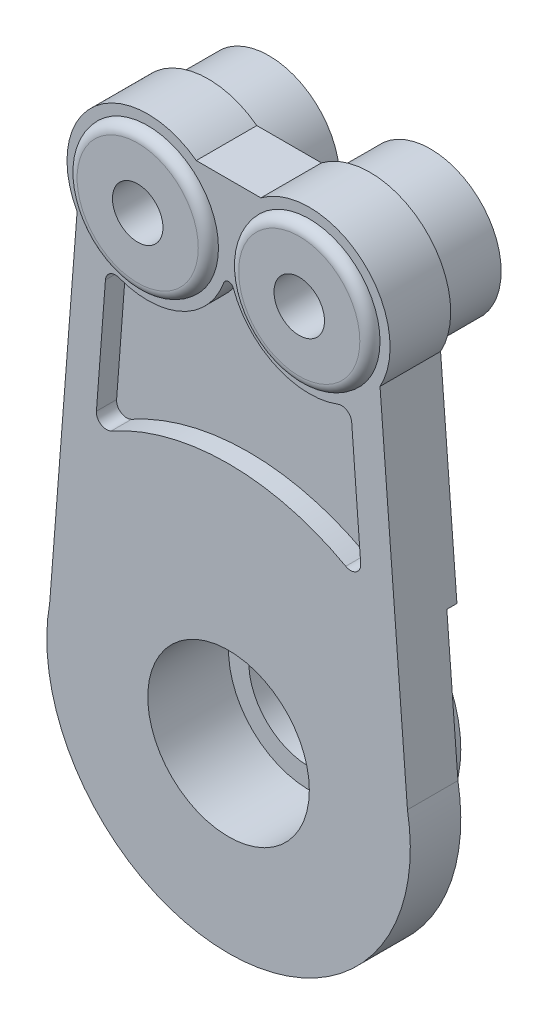
ISO-10303-21;
HEADER;
FILE_DESCRIPTION(('STEP AP214'),'2;1');
FILE_NAME('part.step','',(''),(''),'','','');
FILE_SCHEMA(('AUTOMOTIVE_DESIGN { 1 0 10303 214 1 1 1 1 }'));
ENDSEC;
DATA;
#1=APPLICATION_CONTEXT('core data for automotive mechanical design processes');
#2=APPLICATION_PROTOCOL_DEFINITION('international standard','automotive_design',2000,#1);
#3=PRODUCT_CONTEXT('',#1,'mechanical');
#4=PRODUCT('Part','Part','',(#3));
#5=PRODUCT_RELATED_PRODUCT_CATEGORY('part','',(#4));
#6=PRODUCT_DEFINITION_FORMATION('','',#4);
#7=PRODUCT_DEFINITION_CONTEXT('part definition',#1,'design');
#8=PRODUCT_DEFINITION('design','',#6,#7);
#9=PRODUCT_DEFINITION_SHAPE('','',#8);
#10=(LENGTH_UNIT() NAMED_UNIT(*) SI_UNIT(.MILLI.,.METRE.));
#11=(NAMED_UNIT(*) PLANE_ANGLE_UNIT() SI_UNIT($,.RADIAN.));
#12=(NAMED_UNIT(*) SI_UNIT($,.STERADIAN.) SOLID_ANGLE_UNIT());
#13=UNCERTAINTY_MEASURE_WITH_UNIT(LENGTH_MEASURE(1.E-05),#10,'distance_accuracy_value','');
#14=(GEOMETRIC_REPRESENTATION_CONTEXT(3) GLOBAL_UNCERTAINTY_ASSIGNED_CONTEXT((#13)) GLOBAL_UNIT_ASSIGNED_CONTEXT((#10,
#11,#12)) REPRESENTATION_CONTEXT('',''));
#15=CARTESIAN_POINT('',(0.,0.,0.));
#16=DIRECTION('',(0.,0.,1.));
#17=DIRECTION('',(1.,0.,0.));
#18=AXIS2_PLACEMENT_3D('',#15,#16,#17);
#19=CARTESIAN_POINT('',(0.,0.,0.5));
#20=DIRECTION('',(0.,0.,-1.));
#21=DIRECTION('',(-1.,0.,0.));
#22=AXIS2_PLACEMENT_3D('',#19,#20,#21);
#23=PLANE('',#22);
#24=CARTESIAN_POINT('',(0.,0.,0.5));
#25=DIRECTION('',(0.,0.,-1.));
#26=DIRECTION('',(-1.,0.,0.));
#27=AXIS2_PLACEMENT_3D('',#24,#25,#26);
#28=CIRCLE('',#27,9.);
#29=CARTESIAN_POINT('',(8.85870728557091,1.58849149464924,0.5));
#30=VERTEX_POINT('',#29);
#31=CARTESIAN_POINT('',(1.5,-8.87411967464942,0.5));
#32=VERTEX_POINT('',#31);
#33=EDGE_CURVE('E204',#30,#32,#28,.T.);
#34=ORIENTED_EDGE('',*,*,#33,.T.);
#35=DIRECTION('',(0.,-1.,0.));
#36=VECTOR('',#35,1.);
#37=CARTESIAN_POINT('',(1.5,-5.80947501931113,0.5));
#38=LINE('',#37,#36);
#39=CARTESIAN_POINT('',(1.5,-5.80947501931113,0.5));
#40=VERTEX_POINT('',#39);
#41=EDGE_CURVE('E185',#40,#32,#38,.T.);
#42=ORIENTED_EDGE('',*,*,#41,.F.);
#43=CARTESIAN_POINT('',(0.,0.,0.5));
#44=DIRECTION('',(0.,0.,-1.));
#45=DIRECTION('',(-1.,0.,0.));
#46=AXIS2_PLACEMENT_3D('',#43,#44,#45);
#47=CIRCLE('',#46,6.);
#48=CARTESIAN_POINT('',(-1.5,-5.80947501931113,0.5));
#49=VERTEX_POINT('',#48);
#50=EDGE_CURVE('E196',#49,#40,#47,.T.);
#51=ORIENTED_EDGE('',*,*,#50,.F.);
#52=DIRECTION('',(0.,1.,0.));
#53=VECTOR('',#52,1.);
#54=CARTESIAN_POINT('',(-1.5,-5.80947501931113,0.5));
#55=LINE('',#54,#53);
#56=CARTESIAN_POINT('',(-1.5,-8.87411967464942,0.5));
#57=VERTEX_POINT('',#56);
#58=EDGE_CURVE('E205',#57,#49,#55,.T.);
#59=ORIENTED_EDGE('',*,*,#58,.F.);
#60=CARTESIAN_POINT('',(-8.85870728557089,1.5884914946493,0.5));
#61=VERTEX_POINT('',#60);
#62=EDGE_CURVE('E222',#57,#61,#28,.T.);
#63=ORIENTED_EDGE('',*,*,#62,.T.);
#64=DIRECTION('',(0.0775174605559631,0.996990994597722,0.));
#65=VECTOR('',#64,1.);
#66=CARTESIAN_POINT('',(-8.85870728557089,1.58849149464931,0.5));
#67=LINE('',#66,#65);
#68=CARTESIAN_POINT('',(-8.30904862225171,8.6579276384743,0.5));
#69=VERTEX_POINT('',#68);
#70=EDGE_CURVE('E224',#61,#69,#67,.T.);
#71=ORIENTED_EDGE('',*,*,#70,.T.);
#72=CARTESIAN_POINT('',(0.,0.,0.5));
#73=DIRECTION('',(0.,0.,-1.));
#74=DIRECTION('',(-1.,0.,0.));
#75=AXIS2_PLACEMENT_3D('',#72,#73,#74);
#76=CIRCLE('',#75,12.);
#77=CARTESIAN_POINT('',(8.30904862225171,8.65792763847429,0.5));
#78=VERTEX_POINT('',#77);
#79=EDGE_CURVE('E54',#69,#78,#76,.T.);
#80=ORIENTED_EDGE('',*,*,#79,.T.);
#81=DIRECTION('',(0.0775174605559635,-0.996990994597722,0.));
#82=VECTOR('',#81,1.);
#83=CARTESIAN_POINT('',(8.85870728557091,1.58849149464924,0.5));
#84=LINE('',#83,#82);
#85=EDGE_CURVE('E39',#78,#30,#84,.T.);
#86=ORIENTED_EDGE('',*,*,#85,.T.);
#87=EDGE_LOOP('',(#34,#42,#51,#59,#63,#71,#80,#86));
#88=FACE_BOUND('',#87,.T.);
#89=ADVANCED_FACE('F31',(#88),#23,.T.);
#90=CARTESIAN_POINT('',(0.,0.,3.));
#91=DIRECTION('',(0.,0.,-1.));
#92=DIRECTION('',(-1.,0.,0.));
#93=AXIS2_PLACEMENT_3D('',#90,#91,#92);
#94=CYLINDRICAL_SURFACE('',#93,9.);
#95=ORIENTED_EDGE('',*,*,#33,.F.);
#96=DIRECTION('',(0.,0.,-1.));
#97=VECTOR('',#96,1.);
#98=CARTESIAN_POINT('',(8.85870728557091,1.58849149464924,3.));
#99=LINE('',#98,#97);
#100=CARTESIAN_POINT('',(8.85870728557091,1.58849149464924,3.));
#101=VERTEX_POINT('',#100);
#102=EDGE_CURVE('E367',#101,#30,#99,.T.);
#103=ORIENTED_EDGE('',*,*,#102,.F.);
#104=CARTESIAN_POINT('',(0.,0.,3.));
#105=DIRECTION('',(0.,0.,1.));
#106=DIRECTION('',(1.,0.,0.));
#107=AXIS2_PLACEMENT_3D('',#104,#105,#106);
#108=CIRCLE('',#107,9.);
#109=CARTESIAN_POINT('',(-8.85870728557089,1.5884914946493,3.));
#110=VERTEX_POINT('',#109);
#111=EDGE_CURVE('E350',#110,#101,#108,.T.);
#112=ORIENTED_EDGE('',*,*,#111,.F.);
#113=DIRECTION('',(0.,0.,-1.));
#114=VECTOR('',#113,1.);
#115=CARTESIAN_POINT('',(-8.85870728557089,1.5884914946493,3.));
#116=LINE('',#115,#114);
#117=EDGE_CURVE('E370',#110,#61,#116,.T.);
#118=ORIENTED_EDGE('',*,*,#117,.T.);
#119=ORIENTED_EDGE('',*,*,#62,.F.);
#120=DIRECTION('',(0.,0.,1.));
#121=VECTOR('',#120,1.);
#122=CARTESIAN_POINT('',(-1.5,-8.87411967464942,-2.5));
#123=LINE('',#122,#121);
#124=CARTESIAN_POINT('',(-1.5,-8.87411967464942,-2.5));
#125=VERTEX_POINT('',#124);
#126=EDGE_CURVE('E46',#125,#57,#123,.T.);
#127=ORIENTED_EDGE('',*,*,#126,.F.);
#128=CARTESIAN_POINT('',(0.,0.,-2.5));
#129=DIRECTION('',(0.,0.,-1.));
#130=DIRECTION('',(-1.,0.,0.));
#131=AXIS2_PLACEMENT_3D('',#128,#129,#130);
#132=CIRCLE('',#131,9.);
#133=CARTESIAN_POINT('',(1.5,-8.87411967464942,-2.5));
#134=VERTEX_POINT('',#133);
#135=EDGE_CURVE('E213',#134,#125,#132,.T.);
#136=ORIENTED_EDGE('',*,*,#135,.F.);
#137=DIRECTION('',(0.,0.,1.));
#138=VECTOR('',#137,1.);
#139=CARTESIAN_POINT('',(1.5,-8.87411967464942,-2.5));
#140=LINE('',#139,#138);
#141=EDGE_CURVE('E192',#134,#32,#140,.T.);
#142=ORIENTED_EDGE('',*,*,#141,.T.);
#143=EDGE_LOOP('',(#95,#103,#112,#118,#119,#127,#136,#142));
#144=FACE_BOUND('',#143,.T.);
#145=ADVANCED_FACE('F391',(#144),#94,.T.);
#146=CARTESIAN_POINT('',(-4.,21.,0.));
#147=DIRECTION('',(0.,0.,1.));
#148=DIRECTION('',(1.,0.,0.));
#149=AXIS2_PLACEMENT_3D('',#146,#147,#148);
#150=PLANE('',#149);
#151=CARTESIAN_POINT('',(-4.,21.,0.));
#152=DIRECTION('',(0.,0.,1.));
#153=DIRECTION('',(1.,0.,0.));
#154=AXIS2_PLACEMENT_3D('',#151,#152,#153);
#155=CIRCLE('',#154,3.5);
#156=CARTESIAN_POINT('',(-0.5,21.,0.));
#157=VERTEX_POINT('',#156);
#158=EDGE_CURVE('E382',#157,#157,#155,.F.);
#159=ORIENTED_EDGE('',*,*,#158,.F.);
#160=EDGE_LOOP('',(#159));
#161=FACE_BOUND('',#160,.T.);
#162=DIRECTION('',(-0.0775174605559635,0.996990994597722,0.));
#163=VECTOR('',#162,1.);
#164=CARTESIAN_POINT('',(8.85870728557091,1.58849149464924,0.));
#165=LINE('',#164,#163);
#166=CARTESIAN_POINT('',(8.30904862225171,8.65792763847429,0.));
#167=VERTEX_POINT('',#166);
#168=CARTESIAN_POINT('',(7.5,19.0635083268963,0.));
#169=VERTEX_POINT('',#168);
#170=EDGE_CURVE('E339',#167,#169,#165,.T.);
#171=ORIENTED_EDGE('',*,*,#170,.F.);
#172=CARTESIAN_POINT('',(0.,0.,0.));
#173=DIRECTION('',(0.,0.,-1.));
#174=DIRECTION('',(-1.,0.,0.));
#175=AXIS2_PLACEMENT_3D('',#172,#173,#174);
#176=CIRCLE('',#175,12.);
#177=CARTESIAN_POINT('',(-8.30904862225171,8.6579276384743,0.));
#178=VERTEX_POINT('',#177);
#179=EDGE_CURVE('E191',#178,#167,#176,.T.);
#180=ORIENTED_EDGE('',*,*,#179,.F.);
#181=DIRECTION('',(-0.0775174605559631,-0.996990994597722,0.));
#182=VECTOR('',#181,1.);
#183=CARTESIAN_POINT('',(-8.85870728557089,1.58849149464931,0.));
#184=LINE('',#183,#182);
#185=CARTESIAN_POINT('',(-7.5,19.0635083268963,0.));
#186=VERTEX_POINT('',#185);
#187=EDGE_CURVE('E336',#186,#178,#184,.T.);
#188=ORIENTED_EDGE('',*,*,#187,.F.);
#189=CARTESIAN_POINT('',(-4.,21.,0.));
#190=DIRECTION('',(0.,0.,1.));
#191=DIRECTION('',(1.,0.,0.));
#192=AXIS2_PLACEMENT_3D('',#189,#190,#191);
#193=CIRCLE('',#192,4.);
#194=CARTESIAN_POINT('',(-1.6,24.2,0.));
#195=VERTEX_POINT('',#194);
#196=EDGE_CURVE('E333',#195,#186,#193,.T.);
#197=ORIENTED_EDGE('',*,*,#196,.F.);
#198=DIRECTION('',(-1.,0.,0.));
#199=VECTOR('',#198,1.);
#200=CARTESIAN_POINT('',(1.6,24.2,0.));
#201=LINE('',#200,#199);
#202=CARTESIAN_POINT('',(1.6,24.2,0.));
#203=VERTEX_POINT('',#202);
#204=EDGE_CURVE('E343',#203,#195,#201,.T.);
#205=ORIENTED_EDGE('',*,*,#204,.F.);
#206=CARTESIAN_POINT('',(4.,21.,0.));
#207=DIRECTION('',(0.,0.,1.));
#208=DIRECTION('',(-1.,0.,0.));
#209=AXIS2_PLACEMENT_3D('',#206,#207,#208);
#210=CIRCLE('',#209,4.);
#211=EDGE_CURVE('E341',#169,#203,#210,.T.);
#212=ORIENTED_EDGE('',*,*,#211,.F.);
#213=EDGE_LOOP('',(#171,#180,#188,#197,#205,#212));
#214=FACE_BOUND('',#213,.T.);
#215=CARTESIAN_POINT('',(4.,21.,0.));
#216=DIRECTION('',(0.,0.,1.));
#217=DIRECTION('',(1.,0.,0.));
#218=AXIS2_PLACEMENT_3D('',#215,#216,#217);
#219=CIRCLE('',#218,3.5);
#220=CARTESIAN_POINT('',(7.5,21.,0.));
#221=VERTEX_POINT('',#220);
#222=EDGE_CURVE('E385',#221,#221,#219,.F.);
#223=ORIENTED_EDGE('',*,*,#222,.F.);
#224=EDGE_LOOP('',(#223));
#225=FACE_BOUND('',#224,.T.);
#226=ADVANCED_FACE('F413',(#161,#214,#225),#150,.F.);
#227=CARTESIAN_POINT('',(-4.,21.,3.));
#228=DIRECTION('',(0.,0.,1.));
#229=DIRECTION('',(1.,0.,0.));
#230=AXIS2_PLACEMENT_3D('',#227,#228,#229);
#231=PLANE('',#230);
#232=CARTESIAN_POINT('',(0.,0.,3.));
#233=DIRECTION('',(0.,0.,1.));
#234=DIRECTION('',(1.,0.,0.));
#235=AXIS2_PLACEMENT_3D('',#232,#233,#234);
#236=CIRCLE('',#235,4.);
#237=CARTESIAN_POINT('',(4.,0.,3.));
#238=VERTEX_POINT('',#237);
#239=EDGE_CURVE('E792',#238,#238,#236,.T.);
#240=ORIENTED_EDGE('',*,*,#239,.F.);
#241=EDGE_LOOP('',(#240));
#242=FACE_BOUND('',#241,.T.);
#243=CARTESIAN_POINT('',(-6.04517538410995,10.9410170722539,3.));
#244=DIRECTION('',(0.,0.,1.));
#245=DIRECTION('',(1.,0.,0.));
#246=AXIS2_PLACEMENT_3D('',#243,#244,#245);
#247=CIRCLE('',#246,0.500000000000001);
#248=CARTESIAN_POINT('',(-6.54372583212428,10.9790624502217,3.));
#249=VERTEX_POINT('',#248);
#250=CARTESIAN_POINT('',(-5.80336836874556,10.5033763893637,3.));
#251=VERTEX_POINT('',#250);
#252=EDGE_CURVE('E247',#249,#251,#247,.T.);
#253=ORIENTED_EDGE('',*,*,#252,.F.);
#254=DIRECTION('',(-0.0760907559356129,-0.997100896028655,0.));
#255=VECTOR('',#254,1.);
#256=CARTESIAN_POINT('',(-6.54372583212428,10.9790624502217,3.));
#257=LINE('',#256,#255);
#258=CARTESIAN_POINT('',(-6.0971108584144,16.8315498514872,3.));
#259=VERTEX_POINT('',#258);
#260=EDGE_CURVE('E273',#259,#249,#257,.T.);
#261=ORIENTED_EDGE('',*,*,#260,.F.);
#262=CARTESIAN_POINT('',(-5.59856041040007,16.7935044735194,3.));
#263=DIRECTION('',(0.,0.,1.));
#264=DIRECTION('',(-1.,0.,0.));
#265=AXIS2_PLACEMENT_3D('',#262,#263,#264);
#266=CIRCLE('',#265,0.500000000000002);
#267=CARTESIAN_POINT('',(-5.42094258702228,17.2608928653505,3.));
#268=VERTEX_POINT('',#267);
#269=EDGE_CURVE('E270',#268,#259,#266,.T.);
#270=ORIENTED_EDGE('',*,*,#269,.F.);
#271=CARTESIAN_POINT('',(-4.,21.,3.));
#272=DIRECTION('',(0.,0.,-1.));
#273=DIRECTION('',(1.,0.,0.));
#274=AXIS2_PLACEMENT_3D('',#271,#272,#273);
#275=CIRCLE('',#274,4.);
#276=CARTESIAN_POINT('',(-0.23529411764706,19.6483382008146,3.));
#277=VERTEX_POINT('',#276);
#278=EDGE_CURVE('E267',#277,#268,#275,.T.);
#279=ORIENTED_EDGE('',*,*,#278,.F.);
#280=CARTESIAN_POINT('',(0.,19.5638593383655,3.));
#281=DIRECTION('',(0.,0.,1.));
#282=DIRECTION('',(-1.,0.,0.));
#283=AXIS2_PLACEMENT_3D('',#280,#281,#282);
#284=CIRCLE('',#283,0.250000000000001);
#285=CARTESIAN_POINT('',(0.235294117647059,19.6483382008146,3.));
#286=VERTEX_POINT('',#285);
#287=EDGE_CURVE('E264',#286,#277,#284,.T.);
#288=ORIENTED_EDGE('',*,*,#287,.F.);
#289=CARTESIAN_POINT('',(4.,21.,3.));
#290=DIRECTION('',(0.,0.,-1.));
#291=DIRECTION('',(1.,0.,0.));
#292=AXIS2_PLACEMENT_3D('',#289,#290,#291);
#293=CIRCLE('',#292,4.);
#294=CARTESIAN_POINT('',(5.42094258702228,17.2608928653505,3.));
#295=VERTEX_POINT('',#294);
#296=EDGE_CURVE('E261',#295,#286,#293,.T.);
#297=ORIENTED_EDGE('',*,*,#296,.F.);
#298=CARTESIAN_POINT('',(5.59856041040007,16.7935044735194,3.));
#299=DIRECTION('',(0.,0.,1.));
#300=DIRECTION('',(-1.,0.,0.));
#301=AXIS2_PLACEMENT_3D('',#298,#299,#300);
#302=CIRCLE('',#301,0.5);
#303=CARTESIAN_POINT('',(6.0971108584144,16.8315498514872,3.));
#304=VERTEX_POINT('',#303);
#305=EDGE_CURVE('E258',#304,#295,#302,.T.);
#306=ORIENTED_EDGE('',*,*,#305,.F.);
#307=DIRECTION('',(-0.0760907559356129,0.997100896028655,0.));
#308=VECTOR('',#307,1.);
#309=CARTESIAN_POINT('',(6.54372583212428,10.9790624502217,3.));
#310=LINE('',#309,#308);
#311=CARTESIAN_POINT('',(6.54372583212428,10.9790624502217,3.));
#312=VERTEX_POINT('',#311);
#313=EDGE_CURVE('E255',#312,#304,#310,.T.);
#314=ORIENTED_EDGE('',*,*,#313,.F.);
#315=CARTESIAN_POINT('',(6.04517538410995,10.9410170722539,3.));
#316=DIRECTION('',(0.,0.,1.));
#317=DIRECTION('',(-1.,0.,0.));
#318=AXIS2_PLACEMENT_3D('',#315,#316,#317);
#319=CIRCLE('',#318,0.499999999999999);
#320=CARTESIAN_POINT('',(5.80336836874556,10.5033763893637,3.));
#321=VERTEX_POINT('',#320);
#322=EDGE_CURVE('E252',#321,#312,#319,.T.);
#323=ORIENTED_EDGE('',*,*,#322,.F.);
#324=CARTESIAN_POINT('',(0.,0.,3.));
#325=DIRECTION('',(0.,0.,-1.));
#326=DIRECTION('',(1.,0.,0.));
#327=AXIS2_PLACEMENT_3D('',#324,#325,#326);
#328=CIRCLE('',#327,12.);
#329=EDGE_CURVE('E249',#251,#321,#328,.T.);
#330=ORIENTED_EDGE('',*,*,#329,.F.);
#331=EDGE_LOOP('',(#253,#261,#270,#279,#288,#297,#306,#314,#323,#330));
#332=FACE_BOUND('',#331,.T.);
#333=CARTESIAN_POINT('',(4.,21.,3.));
#334=DIRECTION('',(0.,0.,1.));
#335=DIRECTION('',(1.,0.,0.));
#336=AXIS2_PLACEMENT_3D('',#333,#334,#335);
#337=CIRCLE('',#336,3.5);
#338=CARTESIAN_POINT('',(7.5,21.,3.));
#339=VERTEX_POINT('',#338);
#340=EDGE_CURVE('E330',#339,#339,#337,.T.);
#341=ORIENTED_EDGE('',*,*,#340,.F.);
#342=EDGE_LOOP('',(#341));
#343=FACE_BOUND('',#342,.T.);
#344=CARTESIAN_POINT('',(-4.,21.,3.));
#345=DIRECTION('',(0.,0.,1.));
#346=DIRECTION('',(1.,0.,0.));
#347=AXIS2_PLACEMENT_3D('',#344,#345,#346);
#348=CIRCLE('',#347,4.);
#349=CARTESIAN_POINT('',(-1.6,24.2,3.));
#350=VERTEX_POINT('',#349);
#351=CARTESIAN_POINT('',(-7.5,19.0635083268963,3.));
#352=VERTEX_POINT('',#351);
#353=EDGE_CURVE('E345',#350,#352,#348,.T.);
#354=ORIENTED_EDGE('',*,*,#353,.T.);
#355=DIRECTION('',(-0.0775174605559631,-0.996990994597722,0.));
#356=VECTOR('',#355,1.);
#357=CARTESIAN_POINT('',(-8.85870728557089,1.58849149464931,3.));
#358=LINE('',#357,#356);
#359=EDGE_CURVE('E348',#352,#110,#358,.T.);
#360=ORIENTED_EDGE('',*,*,#359,.T.);
#361=ORIENTED_EDGE('',*,*,#111,.T.);
#362=DIRECTION('',(-0.0775174605559635,0.996990994597722,0.));
#363=VECTOR('',#362,1.);
#364=CARTESIAN_POINT('',(8.85870728557091,1.58849149464924,3.));
#365=LINE('',#364,#363);
#366=CARTESIAN_POINT('',(7.5,19.0635083268963,3.));
#367=VERTEX_POINT('',#366);
#368=EDGE_CURVE('E352',#101,#367,#365,.T.);
#369=ORIENTED_EDGE('',*,*,#368,.T.);
#370=CARTESIAN_POINT('',(4.,21.,3.));
#371=DIRECTION('',(0.,0.,1.));
#372=DIRECTION('',(-1.,0.,0.));
#373=AXIS2_PLACEMENT_3D('',#370,#371,#372);
#374=CIRCLE('',#373,4.);
#375=CARTESIAN_POINT('',(1.6,24.2,3.));
#376=VERTEX_POINT('',#375);
#377=EDGE_CURVE('E354',#367,#376,#374,.T.);
#378=ORIENTED_EDGE('',*,*,#377,.T.);
#379=DIRECTION('',(-1.,0.,0.));
#380=VECTOR('',#379,1.);
#381=CARTESIAN_POINT('',(1.6,24.2,3.));
#382=LINE('',#381,#380);
#383=EDGE_CURVE('E356',#376,#350,#382,.T.);
#384=ORIENTED_EDGE('',*,*,#383,.T.);
#385=EDGE_LOOP('',(#354,#360,#361,#369,#378,#384));
#386=FACE_BOUND('',#385,.T.);
#387=CARTESIAN_POINT('',(-4.,21.,3.));
#388=DIRECTION('',(0.,0.,1.));
#389=DIRECTION('',(1.,0.,0.));
#390=AXIS2_PLACEMENT_3D('',#387,#388,#389);
#391=CIRCLE('',#390,3.5);
#392=CARTESIAN_POINT('',(-0.5,21.,3.));
#393=VERTEX_POINT('',#392);
#394=EDGE_CURVE('E309',#393,#393,#391,.T.);
#395=ORIENTED_EDGE('',*,*,#394,.F.);
#396=EDGE_LOOP('',(#395));
#397=FACE_BOUND('',#396,.T.);
#398=ADVANCED_FACE('F399',(#242,#332,#343,#386,#397),#231,.T.);
#399=CARTESIAN_POINT('',(-4.,21.,3.));
#400=DIRECTION('',(0.,0.,-1.));
#401=DIRECTION('',(-1.,0.,0.));
#402=AXIS2_PLACEMENT_3D('',#399,#400,#401);
#403=CYLINDRICAL_SURFACE('',#402,4.);
#404=ORIENTED_EDGE('',*,*,#196,.T.);
#405=DIRECTION('',(0.,0.,-1.));
#406=VECTOR('',#405,1.);
#407=CARTESIAN_POINT('',(-7.5,19.0635083268963,3.));
#408=LINE('',#407,#406);
#409=EDGE_CURVE('E373',#352,#186,#408,.T.);
#410=ORIENTED_EDGE('',*,*,#409,.F.);
#411=ORIENTED_EDGE('',*,*,#353,.F.);
#412=DIRECTION('',(0.,0.,-1.));
#413=VECTOR('',#412,1.);
#414=CARTESIAN_POINT('',(-1.6,24.2,3.));
#415=LINE('',#414,#413);
#416=EDGE_CURVE('E358',#350,#195,#415,.T.);
#417=ORIENTED_EDGE('',*,*,#416,.T.);
#418=EDGE_LOOP('',(#404,#410,#411,#417));
#419=FACE_BOUND('',#418,.T.);
#420=ADVANCED_FACE('F33',(#419),#403,.T.);
#421=CARTESIAN_POINT('',(-8.85870728557089,1.58849149464931,3.));
#422=DIRECTION('',(0.996990994597722,-0.0775174605559631,0.));
#423=DIRECTION('',(0.0775174605559631,0.996990994597722,0.));
#424=AXIS2_PLACEMENT_3D('',#421,#422,#423);
#425=PLANE('',#424);
#426=ORIENTED_EDGE('',*,*,#187,.T.);
#427=DIRECTION('',(0.,0.,-1.));
#428=VECTOR('',#427,1.);
#429=CARTESIAN_POINT('',(-8.3090486222517,8.6579276384743,0.5));
#430=LINE('',#429,#428);
#431=EDGE_CURVE('E226',#178,#69,#430,.F.);
#432=ORIENTED_EDGE('',*,*,#431,.T.);
#433=ORIENTED_EDGE('',*,*,#70,.F.);
#434=ORIENTED_EDGE('',*,*,#117,.F.);
#435=ORIENTED_EDGE('',*,*,#359,.F.);
#436=ORIENTED_EDGE('',*,*,#409,.T.);
#437=EDGE_LOOP('',(#426,#432,#433,#434,#435,#436));
#438=FACE_BOUND('',#437,.T.);
#439=ADVANCED_FACE('F406',(#438),#425,.F.);
#440=CARTESIAN_POINT('',(8.85870728557091,1.58849149464924,3.));
#441=DIRECTION('',(-0.996990994597722,-0.0775174605559635,0.));
#442=DIRECTION('',(0.0775174605559635,-0.996990994597722,0.));
#443=AXIS2_PLACEMENT_3D('',#440,#441,#442);
#444=PLANE('',#443);
#445=ORIENTED_EDGE('',*,*,#85,.F.);
#446=DIRECTION('',(0.,0.,-1.));
#447=VECTOR('',#446,1.);
#448=CARTESIAN_POINT('',(8.30904862225171,8.65792763847429,0.5));
#449=LINE('',#448,#447);
#450=EDGE_CURVE('E11',#78,#167,#449,.T.);
#451=ORIENTED_EDGE('',*,*,#450,.T.);
#452=ORIENTED_EDGE('',*,*,#170,.T.);
#453=DIRECTION('',(0.,0.,-1.));
#454=VECTOR('',#453,1.);
#455=CARTESIAN_POINT('',(7.5,19.0635083268963,3.));
#456=LINE('',#455,#454);
#457=EDGE_CURVE('E364',#367,#169,#456,.T.);
#458=ORIENTED_EDGE('',*,*,#457,.F.);
#459=ORIENTED_EDGE('',*,*,#368,.F.);
#460=ORIENTED_EDGE('',*,*,#102,.T.);
#461=EDGE_LOOP('',(#445,#451,#452,#458,#459,#460));
#462=FACE_BOUND('',#461,.T.);
#463=ADVANCED_FACE('F395',(#462),#444,.F.);
#464=CARTESIAN_POINT('',(4.,21.,3.));
#465=DIRECTION('',(0.,0.,-1.));
#466=DIRECTION('',(-1.,0.,0.));
#467=AXIS2_PLACEMENT_3D('',#464,#465,#466);
#468=CYLINDRICAL_SURFACE('',#467,4.);
#469=ORIENTED_EDGE('',*,*,#211,.T.);
#470=DIRECTION('',(0.,0.,-1.));
#471=VECTOR('',#470,1.);
#472=CARTESIAN_POINT('',(1.6,24.2,3.));
#473=LINE('',#472,#471);
#474=EDGE_CURVE('E361',#376,#203,#473,.T.);
#475=ORIENTED_EDGE('',*,*,#474,.F.);
#476=ORIENTED_EDGE('',*,*,#377,.F.);
#477=ORIENTED_EDGE('',*,*,#457,.T.);
#478=EDGE_LOOP('',(#469,#475,#476,#477));
#479=FACE_BOUND('',#478,.T.);
#480=ADVANCED_FACE('F418',(#479),#468,.T.);
#481=CARTESIAN_POINT('',(1.6,24.2,3.));
#482=DIRECTION('',(0.,-1.,0.));
#483=DIRECTION('',(0.,0.,-1.));
#484=AXIS2_PLACEMENT_3D('',#481,#482,#483);
#485=PLANE('',#484);
#486=ORIENTED_EDGE('',*,*,#204,.T.);
#487=ORIENTED_EDGE('',*,*,#416,.F.);
#488=ORIENTED_EDGE('',*,*,#383,.F.);
#489=ORIENTED_EDGE('',*,*,#474,.T.);
#490=EDGE_LOOP('',(#486,#487,#488,#489));
#491=FACE_BOUND('',#490,.T.);
#492=ADVANCED_FACE('F421',(#491),#485,.F.);
#493=CARTESIAN_POINT('',(4.,21.,3.5));
#494=DIRECTION('',(0.,0.,1.));
#495=DIRECTION('',(1.,0.,0.));
#496=AXIS2_PLACEMENT_3D('',#493,#494,#495);
#497=PLANE('',#496);
#498=CARTESIAN_POINT('',(4.,21.,3.5));
#499=DIRECTION('',(0.,0.,1.));
#500=DIRECTION('',(1.,0.,0.));
#501=AXIS2_PLACEMENT_3D('',#498,#499,#500);
#502=CIRCLE('',#501,1.25);
#503=CARTESIAN_POINT('',(5.25,21.,3.5));
#504=VERTEX_POINT('',#503);
#505=EDGE_CURVE('E235',#504,#504,#502,.T.);
#506=ORIENTED_EDGE('',*,*,#505,.F.);
#507=EDGE_LOOP('',(#506));
#508=FACE_BOUND('',#507,.T.);
#509=CARTESIAN_POINT('',(4.,21.,3.5));
#510=DIRECTION('',(0.,0.,1.));
#511=DIRECTION('',(1.,0.,0.));
#512=AXIS2_PLACEMENT_3D('',#509,#510,#511);
#513=CIRCLE('',#512,3.);
#514=CARTESIAN_POINT('',(7.,21.,3.5));
#515=VERTEX_POINT('',#514);
#516=EDGE_CURVE('E379',#515,#515,#513,.T.);
#517=ORIENTED_EDGE('',*,*,#516,.T.);
#518=EDGE_LOOP('',(#517));
#519=FACE_BOUND('',#518,.T.);
#520=ADVANCED_FACE('F523',(#508,#519),#497,.T.);
#521=CARTESIAN_POINT('',(-4.,21.,3.5));
#522=DIRECTION('',(0.,0.,1.));
#523=DIRECTION('',(1.,0.,0.));
#524=AXIS2_PLACEMENT_3D('',#521,#522,#523);
#525=PLANE('',#524);
#526=CARTESIAN_POINT('',(-4.,21.,3.5));
#527=DIRECTION('',(0.,0.,1.));
#528=DIRECTION('',(1.,0.,0.));
#529=AXIS2_PLACEMENT_3D('',#526,#527,#528);
#530=CIRCLE('',#529,1.25);
#531=CARTESIAN_POINT('',(-2.75,21.,3.5));
#532=VERTEX_POINT('',#531);
#533=EDGE_CURVE('E229',#532,#532,#530,.T.);
#534=ORIENTED_EDGE('',*,*,#533,.F.);
#535=EDGE_LOOP('',(#534));
#536=FACE_BOUND('',#535,.T.);
#537=CARTESIAN_POINT('',(-4.,21.,3.5));
#538=DIRECTION('',(0.,0.,1.));
#539=DIRECTION('',(1.,0.,0.));
#540=AXIS2_PLACEMENT_3D('',#537,#538,#539);
#541=CIRCLE('',#540,3.);
#542=CARTESIAN_POINT('',(-1.,21.,3.5));
#543=VERTEX_POINT('',#542);
#544=EDGE_CURVE('E376',#543,#543,#541,.T.);
#545=ORIENTED_EDGE('',*,*,#544,.T.);
#546=EDGE_LOOP('',(#545));
#547=FACE_BOUND('',#546,.T.);
#548=ADVANCED_FACE('F519',(#536,#547),#525,.T.);
#549=CARTESIAN_POINT('',(-4.,21.,3.));
#550=DIRECTION('',(0.,0.,1.));
#551=DIRECTION('',(1.,0.,0.));
#552=AXIS2_PLACEMENT_3D('',#549,#550,#551);
#553=TOROIDAL_SURFACE('',#552,3.,0.5);
#554=ORIENTED_EDGE('',*,*,#394,.T.);
#555=EDGE_LOOP('',(#554));
#556=FACE_BOUND('',#555,.T.);
#557=ORIENTED_EDGE('',*,*,#544,.F.);
#558=EDGE_LOOP('',(#557));
#559=FACE_BOUND('',#558,.T.);
#560=ADVANCED_FACE('F515',(#556,#559),#553,.T.);
#561=CARTESIAN_POINT('',(4.,21.,3.));
#562=DIRECTION('',(0.,0.,1.));
#563=DIRECTION('',(1.,0.,0.));
#564=AXIS2_PLACEMENT_3D('',#561,#562,#563);
#565=TOROIDAL_SURFACE('',#564,3.,0.5);
#566=ORIENTED_EDGE('',*,*,#340,.T.);
#567=EDGE_LOOP('',(#566));
#568=FACE_BOUND('',#567,.T.);
#569=ORIENTED_EDGE('',*,*,#516,.F.);
#570=EDGE_LOOP('',(#569));
#571=FACE_BOUND('',#570,.T.);
#572=ADVANCED_FACE('F511',(#568,#571),#565,.T.);
#573=CARTESIAN_POINT('',(-6.04517538410995,10.9410170722539,2.));
#574=DIRECTION('',(0.,0.,1.));
#575=DIRECTION('',(1.,0.,0.));
#576=AXIS2_PLACEMENT_3D('',#573,#574,#575);
#577=CYLINDRICAL_SURFACE('',#576,0.500000000000001);
#578=ORIENTED_EDGE('',*,*,#252,.T.);
#579=DIRECTION('',(0.,0.,1.));
#580=VECTOR('',#579,1.);
#581=CARTESIAN_POINT('',(-5.80336836874556,10.5033763893637,2.));
#582=LINE('',#581,#580);
#583=CARTESIAN_POINT('',(-5.80336836874556,10.5033763893637,2.));
#584=VERTEX_POINT('',#583);
#585=EDGE_CURVE('E306',#584,#251,#582,.T.);
#586=ORIENTED_EDGE('',*,*,#585,.F.);
#587=CARTESIAN_POINT('',(-6.04517538410995,10.9410170722539,2.));
#588=DIRECTION('',(0.,0.,1.));
#589=DIRECTION('',(1.,0.,0.));
#590=AXIS2_PLACEMENT_3D('',#587,#588,#589);
#591=CIRCLE('',#590,0.500000000000001);
#592=CARTESIAN_POINT('',(-6.54372583212428,10.9790624502217,2.));
#593=VERTEX_POINT('',#592);
#594=EDGE_CURVE('E276',#593,#584,#591,.T.);
#595=ORIENTED_EDGE('',*,*,#594,.F.);
#596=DIRECTION('',(0.,0.,1.));
#597=VECTOR('',#596,1.);
#598=CARTESIAN_POINT('',(-6.54372583212428,10.9790624502217,2.));
#599=LINE('',#598,#597);
#600=EDGE_CURVE('E307',#593,#249,#599,.T.);
#601=ORIENTED_EDGE('',*,*,#600,.T.);
#602=EDGE_LOOP('',(#578,#586,#595,#601));
#603=FACE_BOUND('',#602,.T.);
#604=ADVANCED_FACE('F477',(#603),#577,.F.);
#605=CARTESIAN_POINT('',(-6.54372583212428,10.9790624502217,2.));
#606=DIRECTION('',(-0.997100896028655,0.0760907559356129,0.));
#607=DIRECTION('',(-0.0760907559356129,-0.997100896028655,0.));
#608=AXIS2_PLACEMENT_3D('',#605,#606,#607);
#609=PLANE('',#608);
#610=ORIENTED_EDGE('',*,*,#260,.T.);
#611=ORIENTED_EDGE('',*,*,#600,.F.);
#612=DIRECTION('',(-0.0760907559356129,-0.997100896028655,0.));
#613=VECTOR('',#612,1.);
#614=CARTESIAN_POINT('',(-6.54372583212428,10.9790624502217,2.));
#615=LINE('',#614,#613);
#616=CARTESIAN_POINT('',(-6.0971108584144,16.8315498514872,2.));
#617=VERTEX_POINT('',#616);
#618=EDGE_CURVE('E303',#617,#593,#615,.T.);
#619=ORIENTED_EDGE('',*,*,#618,.F.);
#620=DIRECTION('',(0.,0.,1.));
#621=VECTOR('',#620,1.);
#622=CARTESIAN_POINT('',(-6.0971108584144,16.8315498514872,2.));
#623=LINE('',#622,#621);
#624=EDGE_CURVE('E310',#617,#259,#623,.T.);
#625=ORIENTED_EDGE('',*,*,#624,.T.);
#626=EDGE_LOOP('',(#610,#611,#619,#625));
#627=FACE_BOUND('',#626,.T.);
#628=ADVANCED_FACE('F473',(#627),#609,.F.);
#629=CARTESIAN_POINT('',(-5.59856041040007,16.7935044735194,2.));
#630=DIRECTION('',(0.,0.,1.));
#631=DIRECTION('',(1.,0.,0.));
#632=AXIS2_PLACEMENT_3D('',#629,#630,#631);
#633=CYLINDRICAL_SURFACE('',#632,0.500000000000002);
#634=ORIENTED_EDGE('',*,*,#269,.T.);
#635=ORIENTED_EDGE('',*,*,#624,.F.);
#636=CARTESIAN_POINT('',(-5.59856041040007,16.7935044735194,2.));
#637=DIRECTION('',(0.,0.,1.));
#638=DIRECTION('',(-1.,0.,0.));
#639=AXIS2_PLACEMENT_3D('',#636,#637,#638);
#640=CIRCLE('',#639,0.500000000000002);
#641=CARTESIAN_POINT('',(-5.42094258702228,17.2608928653505,2.));
#642=VERTEX_POINT('',#641);
#643=EDGE_CURVE('E300',#642,#617,#640,.T.);
#644=ORIENTED_EDGE('',*,*,#643,.F.);
#645=DIRECTION('',(0.,0.,1.));
#646=VECTOR('',#645,1.);
#647=CARTESIAN_POINT('',(-5.42094258702228,17.2608928653505,2.));
#648=LINE('',#647,#646);
#649=EDGE_CURVE('E312',#642,#268,#648,.T.);
#650=ORIENTED_EDGE('',*,*,#649,.T.);
#651=EDGE_LOOP('',(#634,#635,#644,#650));
#652=FACE_BOUND('',#651,.T.);
#653=ADVANCED_FACE('F476',(#652),#633,.F.);
#654=CARTESIAN_POINT('',(-4.,21.,2.));
#655=DIRECTION('',(0.,0.,1.));
#656=DIRECTION('',(1.,0.,0.));
#657=AXIS2_PLACEMENT_3D('',#654,#655,#656);
#658=CYLINDRICAL_SURFACE('',#657,4.);
#659=ORIENTED_EDGE('',*,*,#278,.T.);
#660=ORIENTED_EDGE('',*,*,#649,.F.);
#661=CARTESIAN_POINT('',(-4.,21.,2.));
#662=DIRECTION('',(0.,0.,-1.));
#663=DIRECTION('',(1.,0.,0.));
#664=AXIS2_PLACEMENT_3D('',#661,#662,#663);
#665=CIRCLE('',#664,4.);
#666=CARTESIAN_POINT('',(-0.23529411764706,19.6483382008146,2.));
#667=VERTEX_POINT('',#666);
#668=EDGE_CURVE('E297',#667,#642,#665,.T.);
#669=ORIENTED_EDGE('',*,*,#668,.F.);
#670=DIRECTION('',(0.,0.,1.));
#671=VECTOR('',#670,1.);
#672=CARTESIAN_POINT('',(-0.23529411764706,19.6483382008146,2.));
#673=LINE('',#672,#671);
#674=EDGE_CURVE('E314',#667,#277,#673,.T.);
#675=ORIENTED_EDGE('',*,*,#674,.T.);
#676=EDGE_LOOP('',(#659,#660,#669,#675));
#677=FACE_BOUND('',#676,.T.);
#678=ADVANCED_FACE('F481',(#677),#658,.T.);
#679=CARTESIAN_POINT('',(0.,19.5638593383655,2.));
#680=DIRECTION('',(0.,0.,1.));
#681=DIRECTION('',(1.,0.,0.));
#682=AXIS2_PLACEMENT_3D('',#679,#680,#681);
#683=CYLINDRICAL_SURFACE('',#682,0.250000000000001);
#684=ORIENTED_EDGE('',*,*,#287,.T.);
#685=ORIENTED_EDGE('',*,*,#674,.F.);
#686=CARTESIAN_POINT('',(0.,19.5638593383655,2.));
#687=DIRECTION('',(0.,0.,1.));
#688=DIRECTION('',(-1.,0.,0.));
#689=AXIS2_PLACEMENT_3D('',#686,#687,#688);
#690=CIRCLE('',#689,0.250000000000001);
#691=CARTESIAN_POINT('',(0.235294117647059,19.6483382008146,2.));
#692=VERTEX_POINT('',#691);
#693=EDGE_CURVE('E294',#692,#667,#690,.T.);
#694=ORIENTED_EDGE('',*,*,#693,.F.);
#695=DIRECTION('',(0.,0.,1.));
#696=VECTOR('',#695,1.);
#697=CARTESIAN_POINT('',(0.235294117647059,19.6483382008146,2.));
#698=LINE('',#697,#696);
#699=EDGE_CURVE('E316',#692,#286,#698,.T.);
#700=ORIENTED_EDGE('',*,*,#699,.T.);
#701=EDGE_LOOP('',(#684,#685,#694,#700));
#702=FACE_BOUND('',#701,.T.);
#703=ADVANCED_FACE('F485',(#702),#683,.F.);
#704=CARTESIAN_POINT('',(4.,21.,2.));
#705=DIRECTION('',(0.,0.,1.));
#706=DIRECTION('',(1.,0.,0.));
#707=AXIS2_PLACEMENT_3D('',#704,#705,#706);
#708=CYLINDRICAL_SURFACE('',#707,4.);
#709=ORIENTED_EDGE('',*,*,#296,.T.);
#710=ORIENTED_EDGE('',*,*,#699,.F.);
#711=CARTESIAN_POINT('',(4.,21.,2.));
#712=DIRECTION('',(0.,0.,-1.));
#713=DIRECTION('',(1.,0.,0.));
#714=AXIS2_PLACEMENT_3D('',#711,#712,#713);
#715=CIRCLE('',#714,4.);
#716=CARTESIAN_POINT('',(5.42094258702228,17.2608928653505,2.));
#717=VERTEX_POINT('',#716);
#718=EDGE_CURVE('E291',#717,#692,#715,.T.);
#719=ORIENTED_EDGE('',*,*,#718,.F.);
#720=DIRECTION('',(0.,0.,1.));
#721=VECTOR('',#720,1.);
#722=CARTESIAN_POINT('',(5.42094258702228,17.2608928653505,2.));
#723=LINE('',#722,#721);
#724=EDGE_CURVE('E318',#717,#295,#723,.T.);
#725=ORIENTED_EDGE('',*,*,#724,.T.);
#726=EDGE_LOOP('',(#709,#710,#719,#725));
#727=FACE_BOUND('',#726,.T.);
#728=ADVANCED_FACE('F489',(#727),#708,.T.);
#729=CARTESIAN_POINT('',(5.59856041040007,16.7935044735194,2.));
#730=DIRECTION('',(0.,0.,1.));
#731=DIRECTION('',(1.,0.,0.));
#732=AXIS2_PLACEMENT_3D('',#729,#730,#731);
#733=CYLINDRICAL_SURFACE('',#732,0.5);
#734=ORIENTED_EDGE('',*,*,#305,.T.);
#735=ORIENTED_EDGE('',*,*,#724,.F.);
#736=CARTESIAN_POINT('',(5.59856041040007,16.7935044735194,2.));
#737=DIRECTION('',(0.,0.,1.));
#738=DIRECTION('',(-1.,0.,0.));
#739=AXIS2_PLACEMENT_3D('',#736,#737,#738);
#740=CIRCLE('',#739,0.5);
#741=CARTESIAN_POINT('',(6.0971108584144,16.8315498514872,2.));
#742=VERTEX_POINT('',#741);
#743=EDGE_CURVE('E288',#742,#717,#740,.T.);
#744=ORIENTED_EDGE('',*,*,#743,.F.);
#745=DIRECTION('',(0.,0.,1.));
#746=VECTOR('',#745,1.);
#747=CARTESIAN_POINT('',(6.0971108584144,16.8315498514872,2.));
#748=LINE('',#747,#746);
#749=EDGE_CURVE('E320',#742,#304,#748,.T.);
#750=ORIENTED_EDGE('',*,*,#749,.T.);
#751=EDGE_LOOP('',(#734,#735,#744,#750));
#752=FACE_BOUND('',#751,.T.);
#753=ADVANCED_FACE('F493',(#752),#733,.F.);
#754=CARTESIAN_POINT('',(6.54372583212428,10.9790624502217,2.));
#755=DIRECTION('',(0.997100896028655,0.0760907559356129,0.));
#756=DIRECTION('',(-0.0760907559356129,0.997100896028655,0.));
#757=AXIS2_PLACEMENT_3D('',#754,#755,#756);
#758=PLANE('',#757);
#759=ORIENTED_EDGE('',*,*,#313,.T.);
#760=ORIENTED_EDGE('',*,*,#749,.F.);
#761=DIRECTION('',(-0.0760907559356129,0.997100896028655,0.));
#762=VECTOR('',#761,1.);
#763=CARTESIAN_POINT('',(6.54372583212428,10.9790624502217,2.));
#764=LINE('',#763,#762);
#765=CARTESIAN_POINT('',(6.54372583212428,10.9790624502217,2.));
#766=VERTEX_POINT('',#765);
#767=EDGE_CURVE('E285',#766,#742,#764,.T.);
#768=ORIENTED_EDGE('',*,*,#767,.F.);
#769=DIRECTION('',(0.,0.,1.));
#770=VECTOR('',#769,1.);
#771=CARTESIAN_POINT('',(6.54372583212428,10.9790624502217,2.));
#772=LINE('',#771,#770);
#773=EDGE_CURVE('E322',#766,#312,#772,.T.);
#774=ORIENTED_EDGE('',*,*,#773,.T.);
#775=EDGE_LOOP('',(#759,#760,#768,#774));
#776=FACE_BOUND('',#775,.T.);
#777=ADVANCED_FACE('F497',(#776),#758,.F.);
#778=CARTESIAN_POINT('',(6.04517538410995,10.9410170722539,2.));
#779=DIRECTION('',(0.,0.,1.));
#780=DIRECTION('',(1.,0.,0.));
#781=AXIS2_PLACEMENT_3D('',#778,#779,#780);
#782=CYLINDRICAL_SURFACE('',#781,0.499999999999999);
#783=ORIENTED_EDGE('',*,*,#322,.T.);
#784=ORIENTED_EDGE('',*,*,#773,.F.);
#785=CARTESIAN_POINT('',(6.04517538410995,10.9410170722539,2.));
#786=DIRECTION('',(0.,0.,1.));
#787=DIRECTION('',(-1.,0.,0.));
#788=AXIS2_PLACEMENT_3D('',#785,#786,#787);
#789=CIRCLE('',#788,0.499999999999999);
#790=CARTESIAN_POINT('',(5.80336836874556,10.5033763893637,2.));
#791=VERTEX_POINT('',#790);
#792=EDGE_CURVE('E282',#791,#766,#789,.T.);
#793=ORIENTED_EDGE('',*,*,#792,.F.);
#794=DIRECTION('',(0.,0.,1.));
#795=VECTOR('',#794,1.);
#796=CARTESIAN_POINT('',(5.80336836874556,10.5033763893637,2.));
#797=LINE('',#796,#795);
#798=EDGE_CURVE('E324',#791,#321,#797,.T.);
#799=ORIENTED_EDGE('',*,*,#798,.T.);
#800=EDGE_LOOP('',(#783,#784,#793,#799));
#801=FACE_BOUND('',#800,.T.);
#802=ADVANCED_FACE('F501',(#801),#782,.F.);
#803=CARTESIAN_POINT('',(0.,0.,2.));
#804=DIRECTION('',(0.,0.,1.));
#805=DIRECTION('',(1.,0.,0.));
#806=AXIS2_PLACEMENT_3D('',#803,#804,#805);
#807=CYLINDRICAL_SURFACE('',#806,12.);
#808=ORIENTED_EDGE('',*,*,#329,.T.);
#809=ORIENTED_EDGE('',*,*,#798,.F.);
#810=CARTESIAN_POINT('',(0.,0.,2.));
#811=DIRECTION('',(0.,0.,-1.));
#812=DIRECTION('',(1.,0.,0.));
#813=AXIS2_PLACEMENT_3D('',#810,#811,#812);
#814=CIRCLE('',#813,12.);
#815=EDGE_CURVE('E279',#584,#791,#814,.T.);
#816=ORIENTED_EDGE('',*,*,#815,.F.);
#817=ORIENTED_EDGE('',*,*,#585,.T.);
#818=EDGE_LOOP('',(#808,#809,#816,#817));
#819=FACE_BOUND('',#818,.T.);
#820=ADVANCED_FACE('F471',(#819),#807,.T.);
#821=CARTESIAN_POINT('',(-6.04517538410995,10.9410170722539,2.));
#822=DIRECTION('',(0.,0.,1.));
#823=DIRECTION('',(1.,0.,0.));
#824=AXIS2_PLACEMENT_3D('',#821,#822,#823);
#825=PLANE('',#824);
#826=ORIENTED_EDGE('',*,*,#594,.T.);
#827=ORIENTED_EDGE('',*,*,#815,.T.);
#828=ORIENTED_EDGE('',*,*,#792,.T.);
#829=ORIENTED_EDGE('',*,*,#767,.T.);
#830=ORIENTED_EDGE('',*,*,#743,.T.);
#831=ORIENTED_EDGE('',*,*,#718,.T.);
#832=ORIENTED_EDGE('',*,*,#693,.T.);
#833=ORIENTED_EDGE('',*,*,#668,.T.);
#834=ORIENTED_EDGE('',*,*,#643,.T.);
#835=ORIENTED_EDGE('',*,*,#618,.T.);
#836=EDGE_LOOP('',(#826,#827,#828,#829,#830,#831,#832,#833,#834,#835));
#837=FACE_BOUND('',#836,.T.);
#838=ADVANCED_FACE('F467',(#837),#825,.T.);
#839=CARTESIAN_POINT('',(-4.,21.,-3.));
#840=DIRECTION('',(0.,0.,1.));
#841=DIRECTION('',(1.,0.,0.));
#842=AXIS2_PLACEMENT_3D('',#839,#840,#841);
#843=CYLINDRICAL_SURFACE('',#842,3.5);
#844=CARTESIAN_POINT('',(-4.,21.,-3.));
#845=DIRECTION('',(0.,0.,-1.));
#846=DIRECTION('',(-1.,0.,0.));
#847=AXIS2_PLACEMENT_3D('',#844,#845,#846);
#848=CIRCLE('',#847,3.5);
#849=CARTESIAN_POINT('',(-7.5,21.,-3.));
#850=VERTEX_POINT('',#849);
#851=EDGE_CURVE('E244',#850,#850,#848,.T.);
#852=ORIENTED_EDGE('',*,*,#851,.F.);
#853=EDGE_LOOP('',(#852));
#854=FACE_BOUND('',#853,.T.);
#855=ORIENTED_EDGE('',*,*,#158,.T.);
#856=EDGE_LOOP('',(#855));
#857=FACE_BOUND('',#856,.T.);
#858=ADVANCED_FACE('F463',(#854,#857),#843,.T.);
#859=CARTESIAN_POINT('',(-4.,21.,-3.));
#860=DIRECTION('',(0.,0.,-1.));
#861=DIRECTION('',(-1.,0.,0.));
#862=AXIS2_PLACEMENT_3D('',#859,#860,#861);
#863=PLANE('',#862);
#864=CARTESIAN_POINT('',(-4.,21.,-3.));
#865=DIRECTION('',(0.,0.,1.));
#866=DIRECTION('',(1.,0.,0.));
#867=AXIS2_PLACEMENT_3D('',#864,#865,#866);
#868=CIRCLE('',#867,1.25);
#869=CARTESIAN_POINT('',(-2.75,21.,-3.));
#870=VERTEX_POINT('',#869);
#871=EDGE_CURVE('E232',#870,#870,#868,.T.);
#872=ORIENTED_EDGE('',*,*,#871,.T.);
#873=EDGE_LOOP('',(#872));
#874=FACE_BOUND('',#873,.T.);
#875=ORIENTED_EDGE('',*,*,#851,.T.);
#876=EDGE_LOOP('',(#875));
#877=FACE_BOUND('',#876,.T.);
#878=ADVANCED_FACE('F459',(#874,#877),#863,.T.);
#879=CARTESIAN_POINT('',(4.,21.,-3.));
#880=DIRECTION('',(0.,0.,1.));
#881=DIRECTION('',(1.,0.,0.));
#882=AXIS2_PLACEMENT_3D('',#879,#880,#881);
#883=CYLINDRICAL_SURFACE('',#882,3.5);
#884=CARTESIAN_POINT('',(4.,21.,-3.));
#885=DIRECTION('',(0.,0.,-1.));
#886=DIRECTION('',(-1.,0.,0.));
#887=AXIS2_PLACEMENT_3D('',#884,#885,#886);
#888=CIRCLE('',#887,3.5);
#889=CARTESIAN_POINT('',(0.5,21.,-3.));
#890=VERTEX_POINT('',#889);
#891=EDGE_CURVE('E241',#890,#890,#888,.T.);
#892=ORIENTED_EDGE('',*,*,#891,.F.);
#893=EDGE_LOOP('',(#892));
#894=FACE_BOUND('',#893,.T.);
#895=ORIENTED_EDGE('',*,*,#222,.T.);
#896=EDGE_LOOP('',(#895));
#897=FACE_BOUND('',#896,.T.);
#898=ADVANCED_FACE('F455',(#894,#897),#883,.T.);
#899=CARTESIAN_POINT('',(4.,21.,-3.));
#900=DIRECTION('',(0.,0.,-1.));
#901=DIRECTION('',(-1.,0.,0.));
#902=AXIS2_PLACEMENT_3D('',#899,#900,#901);
#903=PLANE('',#902);
#904=CARTESIAN_POINT('',(4.,21.,-3.));
#905=DIRECTION('',(0.,0.,1.));
#906=DIRECTION('',(1.,0.,0.));
#907=AXIS2_PLACEMENT_3D('',#904,#905,#906);
#908=CIRCLE('',#907,1.25);
#909=CARTESIAN_POINT('',(5.25,21.,-3.));
#910=VERTEX_POINT('',#909);
#911=EDGE_CURVE('E238',#910,#910,#908,.T.);
#912=ORIENTED_EDGE('',*,*,#911,.T.);
#913=EDGE_LOOP('',(#912));
#914=FACE_BOUND('',#913,.T.);
#915=ORIENTED_EDGE('',*,*,#891,.T.);
#916=EDGE_LOOP('',(#915));
#917=FACE_BOUND('',#916,.T.);
#918=ADVANCED_FACE('F451',(#914,#917),#903,.T.);
#919=CARTESIAN_POINT('',(4.,21.,-3.));
#920=DIRECTION('',(0.,0.,1.));
#921=DIRECTION('',(1.,0.,0.));
#922=AXIS2_PLACEMENT_3D('',#919,#920,#921);
#923=CYLINDRICAL_SURFACE('',#922,1.25);
#924=ORIENTED_EDGE('',*,*,#911,.F.);
#925=EDGE_LOOP('',(#924));
#926=FACE_BOUND('',#925,.T.);
#927=ORIENTED_EDGE('',*,*,#505,.T.);
#928=EDGE_LOOP('',(#927));
#929=FACE_BOUND('',#928,.T.);
#930=ADVANCED_FACE('F447',(#926,#929),#923,.F.);
#931=CARTESIAN_POINT('',(-4.,21.,-3.));
#932=DIRECTION('',(0.,0.,1.));
#933=DIRECTION('',(1.,0.,0.));
#934=AXIS2_PLACEMENT_3D('',#931,#932,#933);
#935=CYLINDRICAL_SURFACE('',#934,1.25);
#936=ORIENTED_EDGE('',*,*,#871,.F.);
#937=EDGE_LOOP('',(#936));
#938=FACE_BOUND('',#937,.T.);
#939=ORIENTED_EDGE('',*,*,#533,.T.);
#940=EDGE_LOOP('',(#939));
#941=FACE_BOUND('',#940,.T.);
#942=ADVANCED_FACE('F444',(#938,#941),#935,.F.);
#943=CARTESIAN_POINT('',(0.,0.,0.5));
#944=DIRECTION('',(0.,0.,-1.));
#945=DIRECTION('',(-1.,0.,0.));
#946=AXIS2_PLACEMENT_3D('',#943,#944,#945);
#947=CYLINDRICAL_SURFACE('',#946,12.);
#948=ORIENTED_EDGE('',*,*,#179,.T.);
#949=ORIENTED_EDGE('',*,*,#450,.F.);
#950=ORIENTED_EDGE('',*,*,#79,.F.);
#951=ORIENTED_EDGE('',*,*,#431,.F.);
#952=EDGE_LOOP('',(#948,#949,#950,#951));
#953=FACE_BOUND('',#952,.T.);
#954=ADVANCED_FACE('F408',(#953),#947,.F.);
#955=CARTESIAN_POINT('',(0.,0.,-2.5));
#956=DIRECTION('',(0.,0.,1.));
#957=DIRECTION('',(1.,0.,0.));
#958=AXIS2_PLACEMENT_3D('',#955,#956,#957);
#959=CYLINDRICAL_SURFACE('',#958,6.);
#960=ORIENTED_EDGE('',*,*,#50,.T.);
#961=DIRECTION('',(0.,0.,1.));
#962=VECTOR('',#961,1.);
#963=CARTESIAN_POINT('',(1.5,-5.80947501931113,-2.5));
#964=LINE('',#963,#962);
#965=CARTESIAN_POINT('',(1.5,-5.80947501931113,-2.5));
#966=VERTEX_POINT('',#965);
#967=EDGE_CURVE('E180',#966,#40,#964,.T.);
#968=ORIENTED_EDGE('',*,*,#967,.F.);
#969=CARTESIAN_POINT('',(0.,0.,-2.5));
#970=DIRECTION('',(0.,0.,-1.));
#971=DIRECTION('',(-1.,0.,0.));
#972=AXIS2_PLACEMENT_3D('',#969,#970,#971);
#973=CIRCLE('',#972,6.);
#974=CARTESIAN_POINT('',(-1.5,-5.80947501931113,-2.5));
#975=VERTEX_POINT('',#974);
#976=EDGE_CURVE('E207',#975,#966,#973,.T.);
#977=ORIENTED_EDGE('',*,*,#976,.F.);
#978=DIRECTION('',(0.,0.,1.));
#979=VECTOR('',#978,1.);
#980=CARTESIAN_POINT('',(-1.5,-5.80947501931113,-2.5));
#981=LINE('',#980,#979);
#982=EDGE_CURVE('E199',#975,#49,#981,.T.);
#983=ORIENTED_EDGE('',*,*,#982,.T.);
#984=EDGE_LOOP('',(#960,#968,#977,#983));
#985=FACE_BOUND('',#984,.T.);
#986=ADVANCED_FACE('F197',(#985),#959,.T.);
#987=CARTESIAN_POINT('',(1.5,-5.80947501931113,-2.5));
#988=DIRECTION('',(-1.,0.,0.));
#989=DIRECTION('',(0.,0.,1.));
#990=AXIS2_PLACEMENT_3D('',#987,#988,#989);
#991=PLANE('',#990);
#992=ORIENTED_EDGE('',*,*,#41,.T.);
#993=ORIENTED_EDGE('',*,*,#141,.F.);
#994=DIRECTION('',(0.,-1.,0.));
#995=VECTOR('',#994,1.);
#996=CARTESIAN_POINT('',(1.5,-5.80947501931113,-2.5));
#997=LINE('',#996,#995);
#998=EDGE_CURVE('E187',#966,#134,#997,.T.);
#999=ORIENTED_EDGE('',*,*,#998,.F.);
#1000=ORIENTED_EDGE('',*,*,#967,.T.);
#1001=EDGE_LOOP('',(#992,#993,#999,#1000));
#1002=FACE_BOUND('',#1001,.T.);
#1003=ADVANCED_FACE('F182',(#1002),#991,.F.);
#1004=CARTESIAN_POINT('',(-1.5,-5.80947501931113,-2.5));
#1005=DIRECTION('',(1.,0.,0.));
#1006=DIRECTION('',(0.,1.,0.));
#1007=AXIS2_PLACEMENT_3D('',#1004,#1005,#1006);
#1008=PLANE('',#1007);
#1009=ORIENTED_EDGE('',*,*,#58,.T.);
#1010=ORIENTED_EDGE('',*,*,#982,.F.);
#1011=DIRECTION('',(0.,1.,0.));
#1012=VECTOR('',#1011,1.);
#1013=CARTESIAN_POINT('',(-1.5,-5.80947501931113,-2.5));
#1014=LINE('',#1013,#1012);
#1015=EDGE_CURVE('E215',#125,#975,#1014,.T.);
#1016=ORIENTED_EDGE('',*,*,#1015,.F.);
#1017=ORIENTED_EDGE('',*,*,#126,.T.);
#1018=EDGE_LOOP('',(#1009,#1010,#1016,#1017));
#1019=FACE_BOUND('',#1018,.T.);
#1020=ADVANCED_FACE('F647',(#1019),#1008,.F.);
#1021=CARTESIAN_POINT('',(0.,0.,-2.5));
#1022=DIRECTION('',(0.,0.,-1.));
#1023=DIRECTION('',(-1.,0.,0.));
#1024=AXIS2_PLACEMENT_3D('',#1021,#1022,#1023);
#1025=PLANE('',#1024);
#1026=CARTESIAN_POINT('',(0.,0.,-2.5));
#1027=DIRECTION('',(0.,0.,-1.));
#1028=DIRECTION('',(-1.,0.,0.));
#1029=AXIS2_PLACEMENT_3D('',#1026,#1027,#1028);
#1030=CIRCLE('',#1029,3.);
#1031=CARTESIAN_POINT('',(-3.,0.,-2.5));
#1032=VERTEX_POINT('',#1031);
#1033=EDGE_CURVE('E787',#1032,#1032,#1030,.T.);
#1034=ORIENTED_EDGE('',*,*,#1033,.F.);
#1035=EDGE_LOOP('',(#1034));
#1036=FACE_BOUND('',#1035,.T.);
#1037=ORIENTED_EDGE('',*,*,#976,.T.);
#1038=ORIENTED_EDGE('',*,*,#998,.T.);
#1039=ORIENTED_EDGE('',*,*,#135,.T.);
#1040=ORIENTED_EDGE('',*,*,#1015,.T.);
#1041=EDGE_LOOP('',(#1037,#1038,#1039,#1040));
#1042=FACE_BOUND('',#1041,.T.);
#1043=ADVANCED_FACE('F653',(#1036,#1042),#1025,.T.);
#1044=CARTESIAN_POINT('',(0.,0.,-1.));
#1045=DIRECTION('',(0.,0.,1.));
#1046=DIRECTION('',(1.,0.,0.));
#1047=AXIS2_PLACEMENT_3D('',#1044,#1045,#1046);
#1048=CYLINDRICAL_SURFACE('',#1047,4.);
#1049=CARTESIAN_POINT('',(0.,0.,-1.));
#1050=DIRECTION('',(0.,0.,1.));
#1051=DIRECTION('',(1.,0.,0.));
#1052=AXIS2_PLACEMENT_3D('',#1049,#1050,#1051);
#1053=CIRCLE('',#1052,4.);
#1054=CARTESIAN_POINT('',(4.,0.,-1.));
#1055=VERTEX_POINT('',#1054);
#1056=EDGE_CURVE('E200',#1055,#1055,#1053,.T.);
#1057=ORIENTED_EDGE('',*,*,#1056,.F.);
#1058=EDGE_LOOP('',(#1057));
#1059=FACE_BOUND('',#1058,.T.);
#1060=ORIENTED_EDGE('',*,*,#239,.T.);
#1061=EDGE_LOOP('',(#1060));
#1062=FACE_BOUND('',#1061,.T.);
#1063=ADVANCED_FACE('F660',(#1059,#1062),#1048,.F.);
#1064=CARTESIAN_POINT('',(0.,0.,-1.));
#1065=DIRECTION('',(0.,0.,1.));
#1066=DIRECTION('',(1.,0.,0.));
#1067=AXIS2_PLACEMENT_3D('',#1064,#1065,#1066);
#1068=PLANE('',#1067);
#1069=CARTESIAN_POINT('',(0.,0.,-1.));
#1070=DIRECTION('',(0.,0.,1.));
#1071=DIRECTION('',(1.,0.,0.));
#1072=AXIS2_PLACEMENT_3D('',#1069,#1070,#1071);
#1073=CIRCLE('',#1072,3.);
#1074=CARTESIAN_POINT('',(3.,0.,-1.));
#1075=VERTEX_POINT('',#1074);
#1076=EDGE_CURVE('E790',#1075,#1075,#1073,.T.);
#1077=ORIENTED_EDGE('',*,*,#1076,.F.);
#1078=EDGE_LOOP('',(#1077));
#1079=FACE_BOUND('',#1078,.T.);
#1080=ORIENTED_EDGE('',*,*,#1056,.T.);
#1081=EDGE_LOOP('',(#1080));
#1082=FACE_BOUND('',#1081,.T.);
#1083=ADVANCED_FACE('F668',(#1079,#1082),#1068,.T.);
#1084=CARTESIAN_POINT('',(0.,0.,-3.));
#1085=DIRECTION('',(0.,0.,1.));
#1086=DIRECTION('',(1.,0.,0.));
#1087=AXIS2_PLACEMENT_3D('',#1084,#1085,#1086);
#1088=CYLINDRICAL_SURFACE('',#1087,3.);
#1089=ORIENTED_EDGE('',*,*,#1033,.T.);
#1090=EDGE_LOOP('',(#1089));
#1091=FACE_BOUND('',#1090,.T.);
#1092=ORIENTED_EDGE('',*,*,#1076,.T.);
#1093=EDGE_LOOP('',(#1092));
#1094=FACE_BOUND('',#1093,.T.);
#1095=ADVANCED_FACE('F676',(#1091,#1094),#1088,.F.);
#1096=CLOSED_SHELL('',(#89,#145,#226,#398,#420,#439,#463,#480,#492,#520,#548,#560,#572,#604,
#628,#653,#678,#703,#728,#753,#777,#802,#820,#838,#858,#878,#898,#918,#930,#942,#954,#986,#1003,
#1020,#1043,#1063,#1083,#1095));
#1097=MANIFOLD_SOLID_BREP('B2',#1096);
#1098=ADVANCED_BREP_SHAPE_REPRESENTATION('',(#18,#1097),#14);
#1099=SHAPE_DEFINITION_REPRESENTATION(#9,#1098);
ENDSEC;
END-ISO-10303-21;
